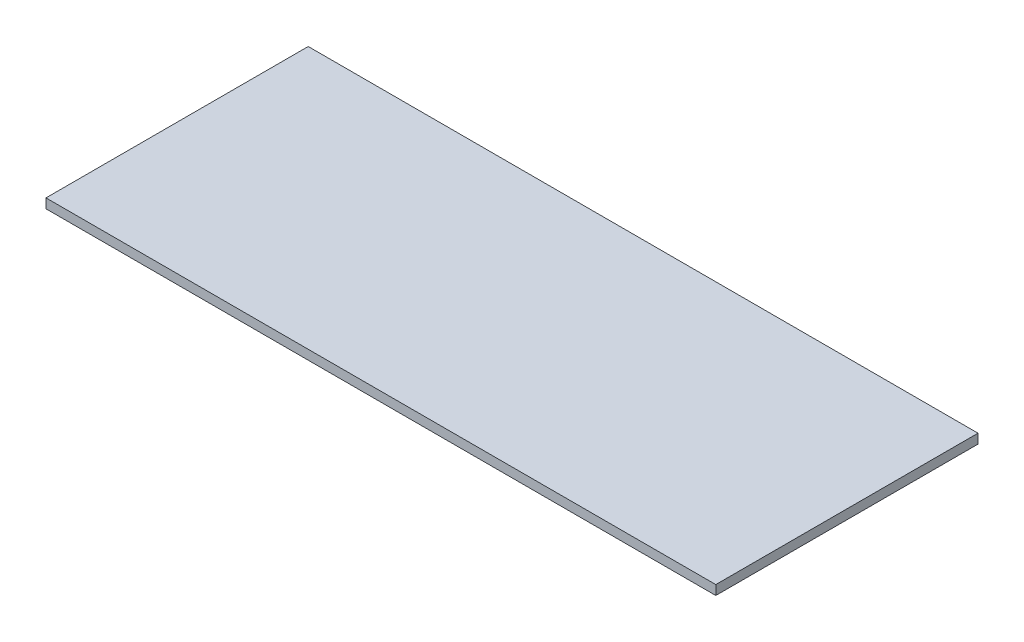
ISO-10303-21;
HEADER;
FILE_DESCRIPTION(('STEP AP214'),'2;1');
FILE_NAME('part.step','',(''),(''),'','','');
FILE_SCHEMA(('AUTOMOTIVE_DESIGN { 1 0 10303 214 1 1 1 1 }'));
ENDSEC;
DATA;
#1=APPLICATION_CONTEXT('core data for automotive mechanical design processes');
#2=APPLICATION_PROTOCOL_DEFINITION('international standard','automotive_design',2000,#1);
#3=PRODUCT_CONTEXT('',#1,'mechanical');
#4=PRODUCT('Part','Part','',(#3));
#5=PRODUCT_RELATED_PRODUCT_CATEGORY('part','',(#4));
#6=PRODUCT_DEFINITION_FORMATION('','',#4);
#7=PRODUCT_DEFINITION_CONTEXT('part definition',#1,'design');
#8=PRODUCT_DEFINITION('design','',#6,#7);
#9=PRODUCT_DEFINITION_SHAPE('','',#8);
#10=(LENGTH_UNIT() NAMED_UNIT(*) SI_UNIT(.MILLI.,.METRE.));
#11=(NAMED_UNIT(*) PLANE_ANGLE_UNIT() SI_UNIT($,.RADIAN.));
#12=(NAMED_UNIT(*) SI_UNIT($,.STERADIAN.) SOLID_ANGLE_UNIT());
#13=UNCERTAINTY_MEASURE_WITH_UNIT(LENGTH_MEASURE(1.E-05),#10,'distance_accuracy_value','');
#14=(GEOMETRIC_REPRESENTATION_CONTEXT(3) GLOBAL_UNCERTAINTY_ASSIGNED_CONTEXT((#13)) GLOBAL_UNIT_ASSIGNED_CONTEXT((#10,
#11,#12)) REPRESENTATION_CONTEXT('',''));
#15=CARTESIAN_POINT('',(0.,0.,0.));
#16=DIRECTION('',(0.,0.,1.));
#17=DIRECTION('',(1.,0.,0.));
#18=AXIS2_PLACEMENT_3D('',#15,#16,#17);
#19=CARTESIAN_POINT('',(673.1,19.05,263.525));
#20=DIRECTION('',(-1.,0.,0.));
#21=DIRECTION('',(0.,0.,1.));
#22=AXIS2_PLACEMENT_3D('',#19,#20,#21);
#23=PLANE('',#22);
#24=DIRECTION('',(0.,0.,-1.));
#25=VECTOR('',#24,1.);
#26=CARTESIAN_POINT('',(673.1,0.,263.525));
#27=LINE('',#26,#25);
#28=CARTESIAN_POINT('',(673.1,0.,263.525));
#29=VERTEX_POINT('',#28);
#30=CARTESIAN_POINT('',(673.1,0.,-263.525));
#31=VERTEX_POINT('',#30);
#32=EDGE_CURVE('E96',#29,#31,#27,.T.);
#33=ORIENTED_EDGE('',*,*,#32,.T.);
#34=DIRECTION('',(0.,-1.,0.));
#35=VECTOR('',#34,1.);
#36=CARTESIAN_POINT('',(673.1,19.05,-263.525));
#37=LINE('',#36,#35);
#38=CARTESIAN_POINT('',(673.1,19.05,-263.525));
#39=VERTEX_POINT('',#38);
#40=EDGE_CURVE('E11',#39,#31,#37,.T.);
#41=ORIENTED_EDGE('',*,*,#40,.F.);
#42=DIRECTION('',(0.,0.,-1.));
#43=VECTOR('',#42,1.);
#44=CARTESIAN_POINT('',(673.1,19.05,263.525));
#45=LINE('',#44,#43);
#46=CARTESIAN_POINT('',(673.1,19.05,263.525));
#47=VERTEX_POINT('',#46);
#48=EDGE_CURVE('E84',#47,#39,#45,.T.);
#49=ORIENTED_EDGE('',*,*,#48,.F.);
#50=DIRECTION('',(0.,-1.,0.));
#51=VECTOR('',#50,1.);
#52=CARTESIAN_POINT('',(673.1,19.05,263.525));
#53=LINE('',#52,#51);
#54=EDGE_CURVE('E92',#47,#29,#53,.T.);
#55=ORIENTED_EDGE('',*,*,#54,.T.);
#56=EDGE_LOOP('',(#33,#41,#49,#55));
#57=FACE_BOUND('',#56,.T.);
#58=ADVANCED_FACE('F33',(#57),#23,.F.);
#59=CARTESIAN_POINT('',(-673.1,19.05,-263.525));
#60=DIRECTION('',(0.,0.,1.));
#61=DIRECTION('',(1.,0.,0.));
#62=AXIS2_PLACEMENT_3D('',#59,#60,#61);
#63=PLANE('',#62);
#64=DIRECTION('',(-1.,0.,0.));
#65=VECTOR('',#64,1.);
#66=CARTESIAN_POINT('',(-673.1,0.,-263.525));
#67=LINE('',#66,#65);
#68=CARTESIAN_POINT('',(-673.1,0.,-263.525));
#69=VERTEX_POINT('',#68);
#70=EDGE_CURVE('E88',#31,#69,#67,.T.);
#71=ORIENTED_EDGE('',*,*,#70,.T.);
#72=DIRECTION('',(0.,-1.,0.));
#73=VECTOR('',#72,1.);
#74=CARTESIAN_POINT('',(-673.1,19.05,-263.525));
#75=LINE('',#74,#73);
#76=CARTESIAN_POINT('',(-673.1,19.05,-263.525));
#77=VERTEX_POINT('',#76);
#78=EDGE_CURVE('E41',#77,#69,#75,.T.);
#79=ORIENTED_EDGE('',*,*,#78,.F.);
#80=DIRECTION('',(-1.,0.,0.));
#81=VECTOR('',#80,1.);
#82=CARTESIAN_POINT('',(-673.1,19.05,-263.525));
#83=LINE('',#82,#81);
#84=EDGE_CURVE('E79',#39,#77,#83,.T.);
#85=ORIENTED_EDGE('',*,*,#84,.F.);
#86=ORIENTED_EDGE('',*,*,#40,.T.);
#87=EDGE_LOOP('',(#71,#79,#85,#86));
#88=FACE_BOUND('',#87,.T.);
#89=ADVANCED_FACE('F87',(#88),#63,.F.);
#90=CARTESIAN_POINT('',(-673.1,19.05,263.525));
#91=DIRECTION('',(1.,0.,0.));
#92=DIRECTION('',(0.,0.,-1.));
#93=AXIS2_PLACEMENT_3D('',#90,#91,#92);
#94=PLANE('',#93);
#95=DIRECTION('',(0.,0.,1.));
#96=VECTOR('',#95,1.);
#97=CARTESIAN_POINT('',(-673.1,0.,263.525));
#98=LINE('',#97,#96);
#99=CARTESIAN_POINT('',(-673.1,0.,263.525));
#100=VERTEX_POINT('',#99);
#101=EDGE_CURVE('E66',#69,#100,#98,.T.);
#102=ORIENTED_EDGE('',*,*,#101,.T.);
#103=DIRECTION('',(0.,-1.,0.));
#104=VECTOR('',#103,1.);
#105=CARTESIAN_POINT('',(-673.1,19.05,263.525));
#106=LINE('',#105,#104);
#107=CARTESIAN_POINT('',(-673.1,19.05,263.525));
#108=VERTEX_POINT('',#107);
#109=EDGE_CURVE('E89',#108,#100,#106,.T.);
#110=ORIENTED_EDGE('',*,*,#109,.F.);
#111=DIRECTION('',(0.,0.,1.));
#112=VECTOR('',#111,1.);
#113=CARTESIAN_POINT('',(-673.1,19.05,263.525));
#114=LINE('',#113,#112);
#115=EDGE_CURVE('E82',#77,#108,#114,.T.);
#116=ORIENTED_EDGE('',*,*,#115,.F.);
#117=ORIENTED_EDGE('',*,*,#78,.T.);
#118=EDGE_LOOP('',(#102,#110,#116,#117));
#119=FACE_BOUND('',#118,.T.);
#120=ADVANCED_FACE('F90',(#119),#94,.F.);
#121=CARTESIAN_POINT('',(-673.1,19.05,263.525));
#122=DIRECTION('',(0.,0.,-1.));
#123=DIRECTION('',(-1.,0.,0.));
#124=AXIS2_PLACEMENT_3D('',#121,#122,#123);
#125=PLANE('',#124);
#126=DIRECTION('',(1.,0.,0.));
#127=VECTOR('',#126,1.);
#128=CARTESIAN_POINT('',(-673.1,0.,263.525));
#129=LINE('',#128,#127);
#130=EDGE_CURVE('E72',#100,#29,#129,.T.);
#131=ORIENTED_EDGE('',*,*,#130,.T.);
#132=ORIENTED_EDGE('',*,*,#54,.F.);
#133=DIRECTION('',(1.,0.,0.));
#134=VECTOR('',#133,1.);
#135=CARTESIAN_POINT('',(-673.1,19.05,263.525));
#136=LINE('',#135,#134);
#137=EDGE_CURVE('E49',#108,#47,#136,.T.);
#138=ORIENTED_EDGE('',*,*,#137,.F.);
#139=ORIENTED_EDGE('',*,*,#109,.T.);
#140=EDGE_LOOP('',(#131,#132,#138,#139));
#141=FACE_BOUND('',#140,.T.);
#142=ADVANCED_FACE('F103',(#141),#125,.F.);
#143=CARTESIAN_POINT('',(0.,19.05,0.));
#144=DIRECTION('',(0.,-1.,0.));
#145=DIRECTION('',(0.,0.,-1.));
#146=AXIS2_PLACEMENT_3D('',#143,#144,#145);
#147=PLANE('',#146);
#148=ORIENTED_EDGE('',*,*,#48,.T.);
#149=ORIENTED_EDGE('',*,*,#84,.T.);
#150=ORIENTED_EDGE('',*,*,#115,.T.);
#151=ORIENTED_EDGE('',*,*,#137,.T.);
#152=EDGE_LOOP('',(#148,#149,#150,#151));
#153=FACE_BOUND('',#152,.T.);
#154=ADVANCED_FACE('F80',(#153),#147,.F.);
#155=CARTESIAN_POINT('',(0.,0.,0.));
#156=DIRECTION('',(0.,-1.,0.));
#157=DIRECTION('',(0.,0.,-1.));
#158=AXIS2_PLACEMENT_3D('',#155,#156,#157);
#159=PLANE('',#158);
#160=ORIENTED_EDGE('',*,*,#32,.F.);
#161=ORIENTED_EDGE('',*,*,#130,.F.);
#162=ORIENTED_EDGE('',*,*,#101,.F.);
#163=ORIENTED_EDGE('',*,*,#70,.F.);
#164=EDGE_LOOP('',(#160,#161,#162,#163));
#165=FACE_BOUND('',#164,.T.);
#166=ADVANCED_FACE('F106',(#165),#159,.T.);
#167=CLOSED_SHELL('',(#58,#89,#120,#142,#154,#166));
#168=MANIFOLD_SOLID_BREP('B2',#167);
#169=ADVANCED_BREP_SHAPE_REPRESENTATION('',(#18,#168),#14);
#170=SHAPE_DEFINITION_REPRESENTATION(#9,#169);
ENDSEC;
END-ISO-10303-21;
